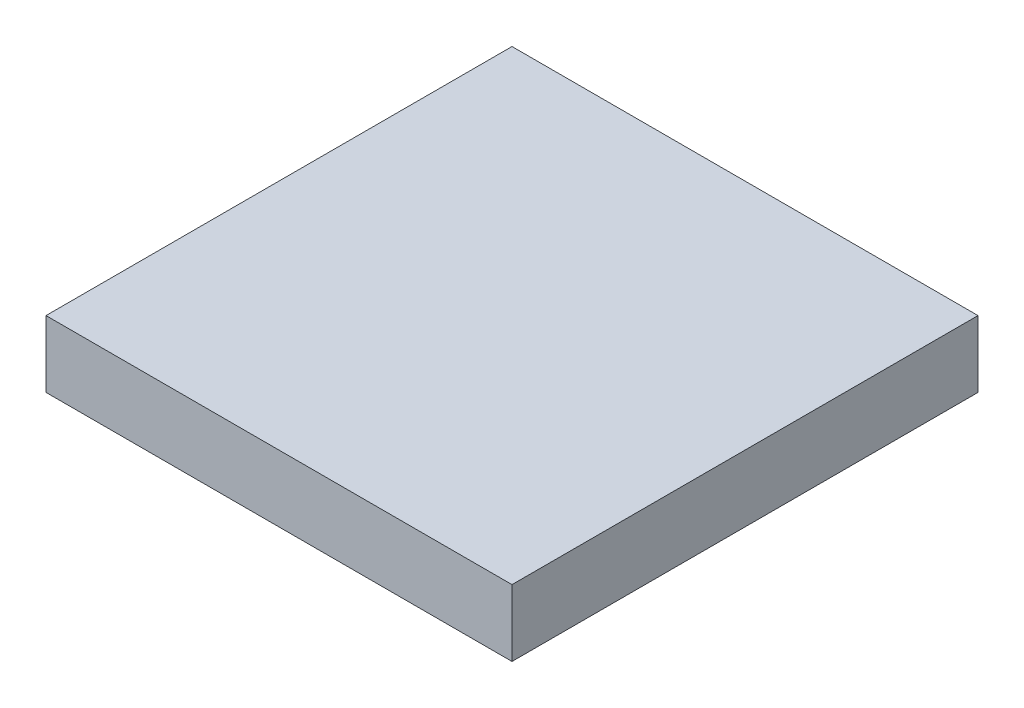
ISO-10303-21;
HEADER;
FILE_DESCRIPTION(('STEP AP214'),'2;1');
FILE_NAME('part.step','',(''),(''),'','','');
FILE_SCHEMA(('AUTOMOTIVE_DESIGN { 1 0 10303 214 1 1 1 1 }'));
ENDSEC;
DATA;
#1=APPLICATION_CONTEXT('core data for automotive mechanical design processes');
#2=APPLICATION_PROTOCOL_DEFINITION('international standard','automotive_design',2000,#1);
#3=PRODUCT_CONTEXT('',#1,'mechanical');
#4=PRODUCT('Part','Part','',(#3));
#5=PRODUCT_RELATED_PRODUCT_CATEGORY('part','',(#4));
#6=PRODUCT_DEFINITION_FORMATION('','',#4);
#7=PRODUCT_DEFINITION_CONTEXT('part definition',#1,'design');
#8=PRODUCT_DEFINITION('design','',#6,#7);
#9=PRODUCT_DEFINITION_SHAPE('','',#8);
#10=(LENGTH_UNIT() NAMED_UNIT(*) SI_UNIT(.MILLI.,.METRE.));
#11=(NAMED_UNIT(*) PLANE_ANGLE_UNIT() SI_UNIT($,.RADIAN.));
#12=(NAMED_UNIT(*) SI_UNIT($,.STERADIAN.) SOLID_ANGLE_UNIT());
#13=UNCERTAINTY_MEASURE_WITH_UNIT(LENGTH_MEASURE(1.E-05),#10,'distance_accuracy_value','');
#14=(GEOMETRIC_REPRESENTATION_CONTEXT(3) GLOBAL_UNCERTAINTY_ASSIGNED_CONTEXT((#13)) GLOBAL_UNIT_ASSIGNED_CONTEXT((#10,
#11,#12)) REPRESENTATION_CONTEXT('',''));
#15=CARTESIAN_POINT('',(0.,0.,0.));
#16=DIRECTION('',(0.,0.,1.));
#17=DIRECTION('',(1.,0.,0.));
#18=AXIS2_PLACEMENT_3D('',#15,#16,#17);
#19=CARTESIAN_POINT('',(0.,12.7,0.));
#20=DIRECTION('',(1.,0.,0.));
#21=DIRECTION('',(0.,0.,-1.));
#22=AXIS2_PLACEMENT_3D('',#19,#20,#21);
#23=PLANE('',#22);
#24=DIRECTION('',(0.,0.,1.));
#25=VECTOR('',#24,1.);
#26=CARTESIAN_POINT('',(0.,0.,0.));
#27=LINE('',#26,#25);
#28=CARTESIAN_POINT('',(0.,0.,0.));
#29=VERTEX_POINT('',#28);
#30=CARTESIAN_POINT('',(0.,0.,88.9));
#31=VERTEX_POINT('',#30);
#32=EDGE_CURVE('E95',#29,#31,#27,.T.);
#33=ORIENTED_EDGE('',*,*,#32,.T.);
#34=DIRECTION('',(0.,-1.,0.));
#35=VECTOR('',#34,1.);
#36=CARTESIAN_POINT('',(0.,12.7,88.9));
#37=LINE('',#36,#35);
#38=CARTESIAN_POINT('',(0.,12.7,88.9));
#39=VERTEX_POINT('',#38);
#40=EDGE_CURVE('E11',#39,#31,#37,.T.);
#41=ORIENTED_EDGE('',*,*,#40,.F.);
#42=DIRECTION('',(0.,0.,1.));
#43=VECTOR('',#42,1.);
#44=CARTESIAN_POINT('',(0.,12.7,0.));
#45=LINE('',#44,#43);
#46=CARTESIAN_POINT('',(0.,12.7,0.));
#47=VERTEX_POINT('',#46);
#48=EDGE_CURVE('E83',#47,#39,#45,.T.);
#49=ORIENTED_EDGE('',*,*,#48,.F.);
#50=DIRECTION('',(0.,-1.,0.));
#51=VECTOR('',#50,1.);
#52=CARTESIAN_POINT('',(0.,12.7,0.));
#53=LINE('',#52,#51);
#54=EDGE_CURVE('E91',#47,#29,#53,.T.);
#55=ORIENTED_EDGE('',*,*,#54,.T.);
#56=EDGE_LOOP('',(#33,#41,#49,#55));
#57=FACE_BOUND('',#56,.T.);
#58=ADVANCED_FACE('F32',(#57),#23,.F.);
#59=CARTESIAN_POINT('',(0.,12.7,88.9));
#60=DIRECTION('',(0.,0.,-1.));
#61=DIRECTION('',(-1.,0.,0.));
#62=AXIS2_PLACEMENT_3D('',#59,#60,#61);
#63=PLANE('',#62);
#64=DIRECTION('',(1.,0.,0.));
#65=VECTOR('',#64,1.);
#66=CARTESIAN_POINT('',(0.,0.,88.9));
#67=LINE('',#66,#65);
#68=CARTESIAN_POINT('',(88.9,0.,88.9));
#69=VERTEX_POINT('',#68);
#70=EDGE_CURVE('E87',#31,#69,#67,.T.);
#71=ORIENTED_EDGE('',*,*,#70,.T.);
#72=DIRECTION('',(0.,-1.,0.));
#73=VECTOR('',#72,1.);
#74=CARTESIAN_POINT('',(88.9,12.7,88.9));
#75=LINE('',#74,#73);
#76=CARTESIAN_POINT('',(88.9,12.7,88.9));
#77=VERTEX_POINT('',#76);
#78=EDGE_CURVE('E40',#77,#69,#75,.T.);
#79=ORIENTED_EDGE('',*,*,#78,.F.);
#80=DIRECTION('',(1.,0.,0.));
#81=VECTOR('',#80,1.);
#82=CARTESIAN_POINT('',(0.,12.7,88.9));
#83=LINE('',#82,#81);
#84=EDGE_CURVE('E78',#39,#77,#83,.T.);
#85=ORIENTED_EDGE('',*,*,#84,.F.);
#86=ORIENTED_EDGE('',*,*,#40,.T.);
#87=EDGE_LOOP('',(#71,#79,#85,#86));
#88=FACE_BOUND('',#87,.T.);
#89=ADVANCED_FACE('F86',(#88),#63,.F.);
#90=CARTESIAN_POINT('',(88.9,12.7,0.));
#91=DIRECTION('',(-1.,0.,0.));
#92=DIRECTION('',(0.,0.,1.));
#93=AXIS2_PLACEMENT_3D('',#90,#91,#92);
#94=PLANE('',#93);
#95=DIRECTION('',(0.,0.,-1.));
#96=VECTOR('',#95,1.);
#97=CARTESIAN_POINT('',(88.9,0.,0.));
#98=LINE('',#97,#96);
#99=CARTESIAN_POINT('',(88.9,0.,0.));
#100=VERTEX_POINT('',#99);
#101=EDGE_CURVE('E65',#69,#100,#98,.T.);
#102=ORIENTED_EDGE('',*,*,#101,.T.);
#103=DIRECTION('',(0.,-1.,0.));
#104=VECTOR('',#103,1.);
#105=CARTESIAN_POINT('',(88.9,12.7,0.));
#106=LINE('',#105,#104);
#107=CARTESIAN_POINT('',(88.9,12.7,0.));
#108=VERTEX_POINT('',#107);
#109=EDGE_CURVE('E88',#108,#100,#106,.T.);
#110=ORIENTED_EDGE('',*,*,#109,.F.);
#111=DIRECTION('',(0.,0.,-1.));
#112=VECTOR('',#111,1.);
#113=CARTESIAN_POINT('',(88.9,12.7,0.));
#114=LINE('',#113,#112);
#115=EDGE_CURVE('E81',#77,#108,#114,.T.);
#116=ORIENTED_EDGE('',*,*,#115,.F.);
#117=ORIENTED_EDGE('',*,*,#78,.T.);
#118=EDGE_LOOP('',(#102,#110,#116,#117));
#119=FACE_BOUND('',#118,.T.);
#120=ADVANCED_FACE('F89',(#119),#94,.F.);
#121=CARTESIAN_POINT('',(0.,12.7,0.));
#122=DIRECTION('',(0.,0.,1.));
#123=DIRECTION('',(1.,0.,0.));
#124=AXIS2_PLACEMENT_3D('',#121,#122,#123);
#125=PLANE('',#124);
#126=DIRECTION('',(-1.,0.,0.));
#127=VECTOR('',#126,1.);
#128=CARTESIAN_POINT('',(0.,0.,0.));
#129=LINE('',#128,#127);
#130=EDGE_CURVE('E71',#100,#29,#129,.T.);
#131=ORIENTED_EDGE('',*,*,#130,.T.);
#132=ORIENTED_EDGE('',*,*,#54,.F.);
#133=DIRECTION('',(-1.,0.,0.));
#134=VECTOR('',#133,1.);
#135=CARTESIAN_POINT('',(0.,12.7,0.));
#136=LINE('',#135,#134);
#137=EDGE_CURVE('E48',#108,#47,#136,.T.);
#138=ORIENTED_EDGE('',*,*,#137,.F.);
#139=ORIENTED_EDGE('',*,*,#109,.T.);
#140=EDGE_LOOP('',(#131,#132,#138,#139));
#141=FACE_BOUND('',#140,.T.);
#142=ADVANCED_FACE('F102',(#141),#125,.F.);
#143=CARTESIAN_POINT('',(0.,12.7,0.));
#144=DIRECTION('',(0.,1.,0.));
#145=DIRECTION('',(0.,0.,1.));
#146=AXIS2_PLACEMENT_3D('',#143,#144,#145);
#147=PLANE('',#146);
#148=ORIENTED_EDGE('',*,*,#48,.T.);
#149=ORIENTED_EDGE('',*,*,#84,.T.);
#150=ORIENTED_EDGE('',*,*,#115,.T.);
#151=ORIENTED_EDGE('',*,*,#137,.T.);
#152=EDGE_LOOP('',(#148,#149,#150,#151));
#153=FACE_BOUND('',#152,.T.);
#154=ADVANCED_FACE('F79',(#153),#147,.T.);
#155=CARTESIAN_POINT('',(0.,0.,0.));
#156=DIRECTION('',(0.,1.,0.));
#157=DIRECTION('',(0.,0.,1.));
#158=AXIS2_PLACEMENT_3D('',#155,#156,#157);
#159=PLANE('',#158);
#160=ORIENTED_EDGE('',*,*,#32,.F.);
#161=ORIENTED_EDGE('',*,*,#130,.F.);
#162=ORIENTED_EDGE('',*,*,#101,.F.);
#163=ORIENTED_EDGE('',*,*,#70,.F.);
#164=EDGE_LOOP('',(#160,#161,#162,#163));
#165=FACE_BOUND('',#164,.T.);
#166=ADVANCED_FACE('F105',(#165),#159,.F.);
#167=CLOSED_SHELL('',(#58,#89,#120,#142,#154,#166));
#168=MANIFOLD_SOLID_BREP('B2',#167);
#169=ADVANCED_BREP_SHAPE_REPRESENTATION('',(#18,#168),#14);
#170=SHAPE_DEFINITION_REPRESENTATION(#9,#169);
ENDSEC;
END-ISO-10303-21;
